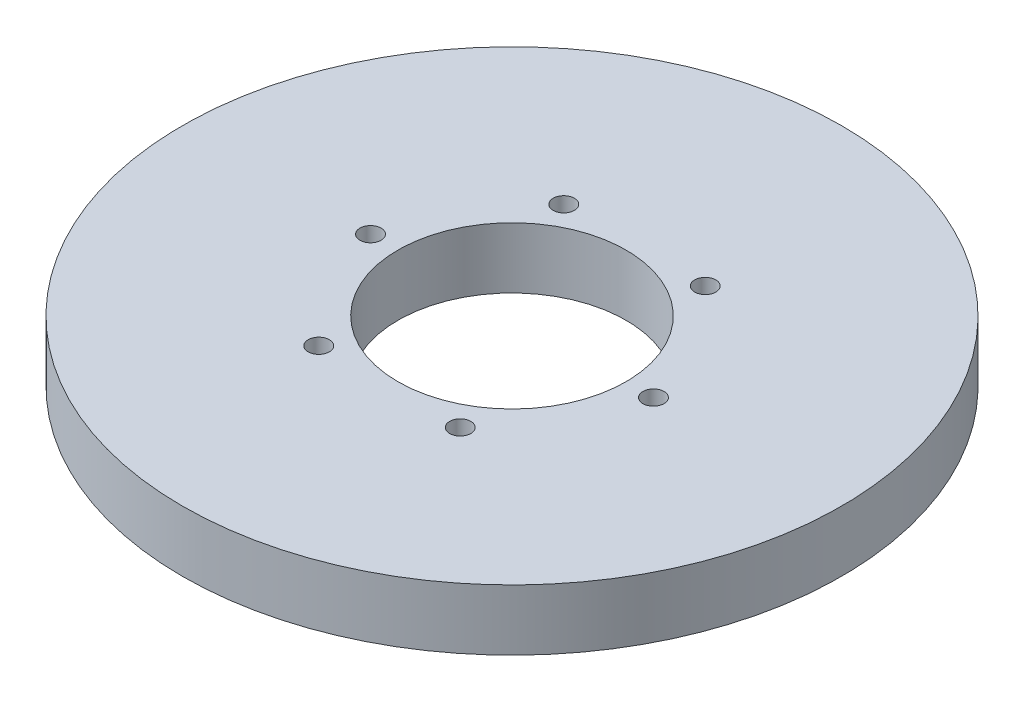
ISO-10303-21;
HEADER;
FILE_DESCRIPTION(('STEP AP214'),'2;1');
FILE_NAME('part.step','',(''),(''),'','','');
FILE_SCHEMA(('AUTOMOTIVE_DESIGN { 1 0 10303 214 1 1 1 1 }'));
ENDSEC;
DATA;
#1=APPLICATION_CONTEXT('core data for automotive mechanical design processes');
#2=APPLICATION_PROTOCOL_DEFINITION('international standard','automotive_design',2000,#1);
#3=PRODUCT_CONTEXT('',#1,'mechanical');
#4=PRODUCT('Part','Part','',(#3));
#5=PRODUCT_RELATED_PRODUCT_CATEGORY('part','',(#4));
#6=PRODUCT_DEFINITION_FORMATION('','',#4);
#7=PRODUCT_DEFINITION_CONTEXT('part definition',#1,'design');
#8=PRODUCT_DEFINITION('design','',#6,#7);
#9=PRODUCT_DEFINITION_SHAPE('','',#8);
#10=(LENGTH_UNIT() NAMED_UNIT(*) SI_UNIT(.MILLI.,.METRE.));
#11=(NAMED_UNIT(*) PLANE_ANGLE_UNIT() SI_UNIT($,.RADIAN.));
#12=(NAMED_UNIT(*) SI_UNIT($,.STERADIAN.) SOLID_ANGLE_UNIT());
#13=UNCERTAINTY_MEASURE_WITH_UNIT(LENGTH_MEASURE(1.E-05),#10,'distance_accuracy_value','');
#14=(GEOMETRIC_REPRESENTATION_CONTEXT(3) GLOBAL_UNCERTAINTY_ASSIGNED_CONTEXT((#13)) GLOBAL_UNIT_ASSIGNED_CONTEXT((#10,
#11,#12)) REPRESENTATION_CONTEXT('',''));
#15=CARTESIAN_POINT('',(0.,0.,0.));
#16=DIRECTION('',(0.,0.,1.));
#17=DIRECTION('',(1.,0.,0.));
#18=AXIS2_PLACEMENT_3D('',#15,#16,#17);
#19=CARTESIAN_POINT('',(0.,12.,0.));
#20=DIRECTION('',(0.,-1.,0.));
#21=DIRECTION('',(0.,0.,-1.));
#22=AXIS2_PLACEMENT_3D('',#19,#20,#21);
#23=CYLINDRICAL_SURFACE('',#22,65.);
#24=CARTESIAN_POINT('',(0.,12.,0.));
#25=DIRECTION('',(0.,1.,0.));
#26=DIRECTION('',(0.,0.,1.));
#27=AXIS2_PLACEMENT_3D('',#24,#25,#26);
#28=CIRCLE('',#27,65.);
#29=CARTESIAN_POINT('',(0.,12.,65.));
#30=VERTEX_POINT('',#29);
#31=EDGE_CURVE('E10',#30,#30,#28,.T.);
#32=ORIENTED_EDGE('',*,*,#31,.F.);
#33=EDGE_LOOP('',(#32));
#34=FACE_BOUND('',#33,.T.);
#35=CARTESIAN_POINT('',(0.,0.,0.));
#36=DIRECTION('',(0.,1.,0.));
#37=DIRECTION('',(0.,0.,1.));
#38=AXIS2_PLACEMENT_3D('',#35,#36,#37);
#39=CIRCLE('',#38,65.);
#40=CARTESIAN_POINT('',(0.,0.,65.));
#41=VERTEX_POINT('',#40);
#42=EDGE_CURVE('E37',#41,#41,#39,.T.);
#43=ORIENTED_EDGE('',*,*,#42,.T.);
#44=EDGE_LOOP('',(#43));
#45=FACE_BOUND('',#44,.T.);
#46=ADVANCED_FACE('F40',(#34,#45),#23,.T.);
#47=CARTESIAN_POINT('',(0.,12.,0.));
#48=DIRECTION('',(0.,1.,0.));
#49=DIRECTION('',(0.,0.,1.));
#50=AXIS2_PLACEMENT_3D('',#47,#48,#49);
#51=PLANE('',#50);
#52=CARTESIAN_POINT('',(-13.9510070272283,12.,-24.1638529879092));
#53=DIRECTION('',(0.,1.,0.));
#54=DIRECTION('',(-0.866025403784433,0.,0.50000000000001));
#55=AXIS2_PLACEMENT_3D('',#52,#53,#54);
#56=CIRCLE('',#55,2.08713035088612);
#57=CARTESIAN_POINT('',(-15.7585149321052,12.,-23.1202878124661));
#58=VERTEX_POINT('',#57);
#59=EDGE_CURVE('E70',#58,#58,#56,.T.);
#60=ORIENTED_EDGE('',*,*,#59,.F.);
#61=EDGE_LOOP('',(#60));
#62=FACE_BOUND('',#61,.T.);
#63=CARTESIAN_POINT('',(13.9510070272278,12.,-24.1638529879095));
#64=DIRECTION('',(0.,1.,0.));
#65=DIRECTION('',(-0.866025403784443,0.,-0.499999999999992));
#66=AXIS2_PLACEMENT_3D('',#63,#64,#65);
#67=CIRCLE('',#66,2.08713035088612);
#68=CARTESIAN_POINT('',(12.1434991223509,12.,-25.2074181633525));
#69=VERTEX_POINT('',#68);
#70=EDGE_CURVE('E71',#69,#69,#67,.T.);
#71=ORIENTED_EDGE('',*,*,#70,.F.);
#72=EDGE_LOOP('',(#71));
#73=FACE_BOUND('',#72,.T.);
#74=CARTESIAN_POINT('',(27.902014054456,12.,0.));
#75=DIRECTION('',(0.,1.,0.));
#76=DIRECTION('',(0.,0.,-1.));
#77=AXIS2_PLACEMENT_3D('',#74,#75,#76);
#78=CIRCLE('',#77,2.08713035088612);
#79=CARTESIAN_POINT('',(27.902014054456,12.,-2.08713035088612));
#80=VERTEX_POINT('',#79);
#81=EDGE_CURVE('E78',#80,#80,#78,.T.);
#82=ORIENTED_EDGE('',*,*,#81,.F.);
#83=EDGE_LOOP('',(#82));
#84=FACE_BOUND('',#83,.T.);
#85=CARTESIAN_POINT('',(13.9510070272281,12.,24.1638529879093));
#86=DIRECTION('',(0.,1.,0.));
#87=DIRECTION('',(0.866025403784436,0.,-0.500000000000004));
#88=AXIS2_PLACEMENT_3D('',#85,#86,#87);
#89=CIRCLE('',#88,2.08713035088612);
#90=CARTESIAN_POINT('',(15.758514932105,12.,23.1202878124662));
#91=VERTEX_POINT('',#90);
#92=EDGE_CURVE('E84',#91,#91,#89,.T.);
#93=ORIENTED_EDGE('',*,*,#92,.F.);
#94=EDGE_LOOP('',(#93));
#95=FACE_BOUND('',#94,.T.);
#96=CARTESIAN_POINT('',(-13.951007027228,12.,24.1638529879094));
#97=DIRECTION('',(0.,1.,0.));
#98=DIRECTION('',(0.86602540378444,0.,0.499999999999998));
#99=AXIS2_PLACEMENT_3D('',#96,#97,#98);
#100=CIRCLE('',#99,2.08713035088612);
#101=CARTESIAN_POINT('',(-12.143499122351,12.,25.2074181633524));
#102=VERTEX_POINT('',#101);
#103=EDGE_CURVE('E61',#102,#102,#100,.T.);
#104=ORIENTED_EDGE('',*,*,#103,.F.);
#105=EDGE_LOOP('',(#104));
#106=FACE_BOUND('',#105,.T.);
#107=CARTESIAN_POINT('',(-27.902014054456,12.,0.));
#108=DIRECTION('',(0.,1.,0.));
#109=DIRECTION('',(0.,0.,1.));
#110=AXIS2_PLACEMENT_3D('',#107,#108,#109);
#111=CIRCLE('',#110,2.08713035088612);
#112=CARTESIAN_POINT('',(-27.902014054456,12.,2.08713035088612));
#113=VERTEX_POINT('',#112);
#114=EDGE_CURVE('E54',#113,#113,#111,.T.);
#115=ORIENTED_EDGE('',*,*,#114,.F.);
#116=EDGE_LOOP('',(#115));
#117=FACE_BOUND('',#116,.T.);
#118=CARTESIAN_POINT('',(0.,12.,0.));
#119=DIRECTION('',(0.,1.,0.));
#120=DIRECTION('',(0.,0.,1.));
#121=AXIS2_PLACEMENT_3D('',#118,#119,#120);
#122=CIRCLE('',#121,22.5);
#123=CARTESIAN_POINT('',(0.,12.,22.5));
#124=VERTEX_POINT('',#123);
#125=EDGE_CURVE('E50',#124,#124,#122,.T.);
#126=ORIENTED_EDGE('',*,*,#125,.F.);
#127=EDGE_LOOP('',(#126));
#128=FACE_BOUND('',#127,.T.);
#129=ORIENTED_EDGE('',*,*,#31,.T.);
#130=EDGE_LOOP('',(#129));
#131=FACE_BOUND('',#130,.T.);
#132=ADVANCED_FACE('F99',(#62,#73,#84,#95,#106,#117,#128,#131),#51,.T.);
#133=CARTESIAN_POINT('',(0.,0.,0.));
#134=DIRECTION('',(0.,1.,0.));
#135=DIRECTION('',(0.,0.,1.));
#136=AXIS2_PLACEMENT_3D('',#133,#134,#135);
#137=PLANE('',#136);
#138=CARTESIAN_POINT('',(0.,0.,0.));
#139=DIRECTION('',(0.,1.,0.));
#140=DIRECTION('',(0.,0.,1.));
#141=AXIS2_PLACEMENT_3D('',#138,#139,#140);
#142=CIRCLE('',#141,22.5);
#143=CARTESIAN_POINT('',(0.,0.,22.5));
#144=VERTEX_POINT('',#143);
#145=EDGE_CURVE('E47',#144,#144,#142,.T.);
#146=ORIENTED_EDGE('',*,*,#145,.T.);
#147=EDGE_LOOP('',(#146));
#148=FACE_BOUND('',#147,.T.);
#149=ORIENTED_EDGE('',*,*,#42,.F.);
#150=EDGE_LOOP('',(#149));
#151=FACE_BOUND('',#150,.T.);
#152=ADVANCED_FACE('F103',(#148,#151),#137,.F.);
#153=CARTESIAN_POINT('',(0.,12.,0.));
#154=DIRECTION('',(0.,-1.,0.));
#155=DIRECTION('',(0.,0.,-1.));
#156=AXIS2_PLACEMENT_3D('',#153,#154,#155);
#157=CYLINDRICAL_SURFACE('',#156,22.5);
#158=ORIENTED_EDGE('',*,*,#125,.T.);
#159=EDGE_LOOP('',(#158));
#160=FACE_BOUND('',#159,.T.);
#161=ORIENTED_EDGE('',*,*,#145,.F.);
#162=EDGE_LOOP('',(#161));
#163=FACE_BOUND('',#162,.T.);
#164=ADVANCED_FACE('F115',(#160,#163),#157,.F.);
#165=CARTESIAN_POINT('',(-27.902014054456,0.739890858404556,0.));
#166=DIRECTION('',(0.,1.,0.));
#167=DIRECTION('',(0.,0.,1.));
#168=AXIS2_PLACEMENT_3D('',#165,#166,#167);
#169=CYLINDRICAL_SURFACE('',#168,2.08713035088612);
#170=CARTESIAN_POINT('',(-27.902014054456,0.739890858404556,0.));
#171=DIRECTION('',(0.,1.,0.));
#172=DIRECTION('',(0.,0.,1.));
#173=AXIS2_PLACEMENT_3D('',#170,#171,#172);
#174=CIRCLE('',#173,2.08713035088612);
#175=CARTESIAN_POINT('',(-27.902014054456,0.739890858404556,2.08713035088612));
#176=VERTEX_POINT('',#175);
#177=EDGE_CURVE('E55',#176,#176,#174,.T.);
#178=ORIENTED_EDGE('',*,*,#177,.F.);
#179=EDGE_LOOP('',(#178));
#180=FACE_BOUND('',#179,.T.);
#181=ORIENTED_EDGE('',*,*,#114,.T.);
#182=EDGE_LOOP('',(#181));
#183=FACE_BOUND('',#182,.T.);
#184=ADVANCED_FACE('F113',(#180,#183),#169,.F.);
#185=CARTESIAN_POINT('',(-27.902014054456,0.739890858404556,0.));
#186=DIRECTION('',(0.,1.,0.));
#187=DIRECTION('',(0.,0.,1.));
#188=AXIS2_PLACEMENT_3D('',#185,#186,#187);
#189=PLANE('',#188);
#190=ORIENTED_EDGE('',*,*,#177,.T.);
#191=EDGE_LOOP('',(#190));
#192=FACE_BOUND('',#191,.T.);
#193=ADVANCED_FACE('F144',(#192),#189,.T.);
#194=CARTESIAN_POINT('',(-13.951007027228,0.739890858404556,24.1638529879094));
#195=DIRECTION('',(0.,1.,0.));
#196=DIRECTION('',(0.,0.,1.));
#197=AXIS2_PLACEMENT_3D('',#194,#195,#196);
#198=CYLINDRICAL_SURFACE('',#197,2.08713035088612);
#199=CARTESIAN_POINT('',(-13.951007027228,0.739890858404556,24.1638529879094));
#200=DIRECTION('',(0.,1.,0.));
#201=DIRECTION('',(0.86602540378444,0.,0.499999999999998));
#202=AXIS2_PLACEMENT_3D('',#199,#200,#201);
#203=CIRCLE('',#202,2.08713035088612);
#204=CARTESIAN_POINT('',(-12.143499122351,0.739890858404556,25.2074181633524));
#205=VERTEX_POINT('',#204);
#206=EDGE_CURVE('E59',#205,#205,#203,.T.);
#207=ORIENTED_EDGE('',*,*,#206,.F.);
#208=EDGE_LOOP('',(#207));
#209=FACE_BOUND('',#208,.T.);
#210=ORIENTED_EDGE('',*,*,#103,.T.);
#211=EDGE_LOOP('',(#210));
#212=FACE_BOUND('',#211,.T.);
#213=ADVANCED_FACE('F153',(#209,#212),#198,.F.);
#214=CARTESIAN_POINT('',(-13.951007027228,0.739890858404556,24.1638529879094));
#215=DIRECTION('',(0.,1.,0.));
#216=DIRECTION('',(0.86602540378444,0.,0.499999999999998));
#217=AXIS2_PLACEMENT_3D('',#214,#215,#216);
#218=PLANE('',#217);
#219=ORIENTED_EDGE('',*,*,#206,.T.);
#220=EDGE_LOOP('',(#219));
#221=FACE_BOUND('',#220,.T.);
#222=ADVANCED_FACE('F96',(#221),#218,.T.);
#223=CARTESIAN_POINT('',(13.9510070272281,0.739890858404556,24.1638529879093));
#224=DIRECTION('',(0.,1.,0.));
#225=DIRECTION('',(0.,0.,1.));
#226=AXIS2_PLACEMENT_3D('',#223,#224,#225);
#227=CYLINDRICAL_SURFACE('',#226,2.08713035088612);
#228=CARTESIAN_POINT('',(13.9510070272281,0.739890858404556,24.1638529879093));
#229=DIRECTION('',(0.,1.,0.));
#230=DIRECTION('',(0.866025403784436,0.,-0.500000000000004));
#231=AXIS2_PLACEMENT_3D('',#228,#229,#230);
#232=CIRCLE('',#231,2.08713035088612);
#233=CARTESIAN_POINT('',(15.758514932105,0.739890858404556,23.1202878124662));
#234=VERTEX_POINT('',#233);
#235=EDGE_CURVE('E63',#234,#234,#232,.T.);
#236=ORIENTED_EDGE('',*,*,#235,.F.);
#237=EDGE_LOOP('',(#236));
#238=FACE_BOUND('',#237,.T.);
#239=ORIENTED_EDGE('',*,*,#92,.T.);
#240=EDGE_LOOP('',(#239));
#241=FACE_BOUND('',#240,.T.);
#242=ADVANCED_FACE('F91',(#238,#241),#227,.F.);
#243=CARTESIAN_POINT('',(13.9510070272281,0.739890858404556,24.1638529879093));
#244=DIRECTION('',(0.,1.,0.));
#245=DIRECTION('',(0.866025403784436,0.,-0.500000000000004));
#246=AXIS2_PLACEMENT_3D('',#243,#244,#245);
#247=PLANE('',#246);
#248=ORIENTED_EDGE('',*,*,#235,.T.);
#249=EDGE_LOOP('',(#248));
#250=FACE_BOUND('',#249,.T.);
#251=ADVANCED_FACE('F93',(#250),#247,.T.);
#252=CARTESIAN_POINT('',(27.902014054456,0.739890858404556,0.));
#253=DIRECTION('',(0.,1.,0.));
#254=DIRECTION('',(0.,0.,1.));
#255=AXIS2_PLACEMENT_3D('',#252,#253,#254);
#256=CYLINDRICAL_SURFACE('',#255,2.08713035088612);
#257=CARTESIAN_POINT('',(27.902014054456,0.739890858404556,0.));
#258=DIRECTION('',(0.,1.,0.));
#259=DIRECTION('',(0.,0.,-1.));
#260=AXIS2_PLACEMENT_3D('',#257,#258,#259);
#261=CIRCLE('',#260,2.08713035088612);
#262=CARTESIAN_POINT('',(27.902014054456,0.739890858404556,-2.08713035088612));
#263=VERTEX_POINT('',#262);
#264=EDGE_CURVE('E85',#263,#263,#261,.T.);
#265=ORIENTED_EDGE('',*,*,#264,.F.);
#266=EDGE_LOOP('',(#265));
#267=FACE_BOUND('',#266,.T.);
#268=ORIENTED_EDGE('',*,*,#81,.T.);
#269=EDGE_LOOP('',(#268));
#270=FACE_BOUND('',#269,.T.);
#271=ADVANCED_FACE('F187',(#267,#270),#256,.F.);
#272=CARTESIAN_POINT('',(27.902014054456,0.739890858404556,0.));
#273=DIRECTION('',(0.,1.,0.));
#274=DIRECTION('',(0.,0.,-1.));
#275=AXIS2_PLACEMENT_3D('',#272,#273,#274);
#276=PLANE('',#275);
#277=ORIENTED_EDGE('',*,*,#264,.T.);
#278=EDGE_LOOP('',(#277));
#279=FACE_BOUND('',#278,.T.);
#280=ADVANCED_FACE('F198',(#279),#276,.T.);
#281=CARTESIAN_POINT('',(13.9510070272278,0.739890858404556,-24.1638529879095));
#282=DIRECTION('',(0.,1.,0.));
#283=DIRECTION('',(0.,0.,1.));
#284=AXIS2_PLACEMENT_3D('',#281,#282,#283);
#285=CYLINDRICAL_SURFACE('',#284,2.08713035088612);
#286=CARTESIAN_POINT('',(13.9510070272278,0.739890858404556,-24.1638529879095));
#287=DIRECTION('',(0.,1.,0.));
#288=DIRECTION('',(-0.866025403784443,0.,-0.499999999999992));
#289=AXIS2_PLACEMENT_3D('',#286,#287,#288);
#290=CIRCLE('',#289,2.08713035088612);
#291=CARTESIAN_POINT('',(12.1434991223509,0.739890858404556,-25.2074181633525));
#292=VERTEX_POINT('',#291);
#293=EDGE_CURVE('E76',#292,#292,#290,.T.);
#294=ORIENTED_EDGE('',*,*,#293,.F.);
#295=EDGE_LOOP('',(#294));
#296=FACE_BOUND('',#295,.T.);
#297=ORIENTED_EDGE('',*,*,#70,.T.);
#298=EDGE_LOOP('',(#297));
#299=FACE_BOUND('',#298,.T.);
#300=ADVANCED_FACE('F202',(#296,#299),#285,.F.);
#301=CARTESIAN_POINT('',(13.9510070272278,0.739890858404556,-24.1638529879095));
#302=DIRECTION('',(0.,1.,0.));
#303=DIRECTION('',(-0.866025403784443,0.,-0.499999999999992));
#304=AXIS2_PLACEMENT_3D('',#301,#302,#303);
#305=PLANE('',#304);
#306=ORIENTED_EDGE('',*,*,#293,.T.);
#307=EDGE_LOOP('',(#306));
#308=FACE_BOUND('',#307,.T.);
#309=ADVANCED_FACE('F212',(#308),#305,.T.);
#310=CARTESIAN_POINT('',(-13.9510070272283,0.739890858404556,-24.1638529879092));
#311=DIRECTION('',(0.,1.,0.));
#312=DIRECTION('',(0.,0.,1.));
#313=AXIS2_PLACEMENT_3D('',#310,#311,#312);
#314=CYLINDRICAL_SURFACE('',#313,2.08713035088612);
#315=CARTESIAN_POINT('',(-13.9510070272283,0.739890858404556,-24.1638529879092));
#316=DIRECTION('',(0.,1.,0.));
#317=DIRECTION('',(-0.866025403784433,0.,0.50000000000001));
#318=AXIS2_PLACEMENT_3D('',#315,#316,#317);
#319=CIRCLE('',#318,2.08713035088612);
#320=CARTESIAN_POINT('',(-15.7585149321052,0.739890858404556,-23.1202878124661));
#321=VERTEX_POINT('',#320);
#322=EDGE_CURVE('E69',#321,#321,#319,.T.);
#323=ORIENTED_EDGE('',*,*,#322,.F.);
#324=EDGE_LOOP('',(#323));
#325=FACE_BOUND('',#324,.T.);
#326=ORIENTED_EDGE('',*,*,#59,.T.);
#327=EDGE_LOOP('',(#326));
#328=FACE_BOUND('',#327,.T.);
#329=ADVANCED_FACE('F224',(#325,#328),#314,.F.);
#330=CARTESIAN_POINT('',(-13.9510070272283,0.739890858404556,-24.1638529879092));
#331=DIRECTION('',(0.,1.,0.));
#332=DIRECTION('',(-0.866025403784433,0.,0.50000000000001));
#333=AXIS2_PLACEMENT_3D('',#330,#331,#332);
#334=PLANE('',#333);
#335=ORIENTED_EDGE('',*,*,#322,.T.);
#336=EDGE_LOOP('',(#335));
#337=FACE_BOUND('',#336,.T.);
#338=ADVANCED_FACE('F235',(#337),#334,.T.);
#339=CLOSED_SHELL('',(#46,#132,#152,#164,#184,#193,#213,#222,#242,#251,#271,#280,#300,#309,#329,#338));
#340=MANIFOLD_SOLID_BREP('B2',#339);
#341=ADVANCED_BREP_SHAPE_REPRESENTATION('',(#18,#340),#14);
#342=SHAPE_DEFINITION_REPRESENTATION(#9,#341);
ENDSEC;
END-ISO-10303-21;
